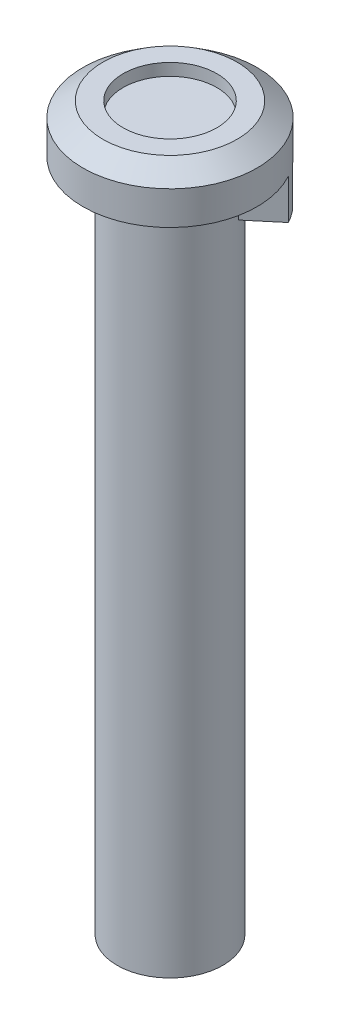
ISO-10303-21;
HEADER;
FILE_DESCRIPTION(('STEP AP214'),'2;1');
FILE_NAME('part.step','',(''),(''),'','','');
FILE_SCHEMA(('AUTOMOTIVE_DESIGN { 1 0 10303 214 1 1 1 1 }'));
ENDSEC;
DATA;
#1=APPLICATION_CONTEXT('core data for automotive mechanical design processes');
#2=APPLICATION_PROTOCOL_DEFINITION('international standard','automotive_design',2000,#1);
#3=PRODUCT_CONTEXT('',#1,'mechanical');
#4=PRODUCT('Part','Part','',(#3));
#5=PRODUCT_RELATED_PRODUCT_CATEGORY('part','',(#4));
#6=PRODUCT_DEFINITION_FORMATION('','',#4);
#7=PRODUCT_DEFINITION_CONTEXT('part definition',#1,'design');
#8=PRODUCT_DEFINITION('design','',#6,#7);
#9=PRODUCT_DEFINITION_SHAPE('','',#8);
#10=(LENGTH_UNIT() NAMED_UNIT(*) SI_UNIT(.MILLI.,.METRE.));
#11=(NAMED_UNIT(*) PLANE_ANGLE_UNIT() SI_UNIT($,.RADIAN.));
#12=(NAMED_UNIT(*) SI_UNIT($,.STERADIAN.) SOLID_ANGLE_UNIT());
#13=UNCERTAINTY_MEASURE_WITH_UNIT(LENGTH_MEASURE(1.E-05),#10,'distance_accuracy_value','');
#14=(GEOMETRIC_REPRESENTATION_CONTEXT(3) GLOBAL_UNCERTAINTY_ASSIGNED_CONTEXT((#13)) GLOBAL_UNIT_ASSIGNED_CONTEXT((#10,
#11,#12)) REPRESENTATION_CONTEXT('',''));
#15=CARTESIAN_POINT('',(0.,0.,0.));
#16=DIRECTION('',(0.,0.,1.));
#17=DIRECTION('',(1.,0.,0.));
#18=AXIS2_PLACEMENT_3D('',#15,#16,#17);
#19=CARTESIAN_POINT('',(-0.803484512108176,0.,-0.957555553898721));
#20=DIRECTION('',(-0.642787609686541,0.,-0.766044443118977));
#21=DIRECTION('',(-0.766044443118977,0.,0.64278760968654));
#22=AXIS2_PLACEMENT_3D('',#19,#20,#21);
#23=PLANE('',#22);
#24=DIRECTION('',(-0.766044443118977,0.,0.64278760968654));
#25=VECTOR('',#24,1.);
#26=CARTESIAN_POINT('',(-0.803484512108176,0.,-0.957555553898721));
#27=LINE('',#26,#25);
#28=CARTESIAN_POINT('',(4.08286434101432,0.,-5.05768907435735));
#29=VERTEX_POINT('',#28);
#30=CARTESIAN_POINT('',(2.06688309626916,0.,-3.36607995543136));
#31=VERTEX_POINT('',#30);
#32=EDGE_CURVE('E110',#29,#31,#27,.T.);
#33=ORIENTED_EDGE('',*,*,#32,.F.);
#34=DIRECTION('',(0.,1.,0.));
#35=VECTOR('',#34,1.);
#36=CARTESIAN_POINT('',(4.08286434101433,-50.3,-5.05768907435735));
#37=LINE('',#36,#35);
#38=CARTESIAN_POINT('',(4.08286434101432,-0.121324588913463,-5.05768907435735));
#39=VERTEX_POINT('',#38);
#40=EDGE_CURVE('E98',#29,#39,#37,.F.);
#41=ORIENTED_EDGE('',*,*,#40,.T.);
#42=DIRECTION('',(0.541675220419704,0.707106781186544,-0.454519477672047));
#43=VECTOR('',#42,1.);
#44=CARTESIAN_POINT('',(4.17580436816517,0.,-5.13567501686123));
#45=LINE('',#44,#43);
#46=CARTESIAN_POINT('',(2.06688309626916,-2.75300120096093,-3.36607995543137));
#47=VERTEX_POINT('',#46);
#48=EDGE_CURVE('E105',#47,#39,#45,.T.);
#49=ORIENTED_EDGE('',*,*,#48,.F.);
#50=DIRECTION('',(0.,1.,0.));
#51=VECTOR('',#50,1.);
#52=CARTESIAN_POINT('',(2.06688309626916,55.,-3.36607995543137));
#53=LINE('',#52,#51);
#54=EDGE_CURVE('E117',#31,#47,#53,.F.);
#55=ORIENTED_EDGE('',*,*,#54,.F.);
#56=EDGE_LOOP('',(#33,#41,#49,#55));
#57=FACE_BOUND('',#56,.T.);
#58=ADVANCED_FACE('F37',(#57),#23,.T.);
#59=CARTESIAN_POINT('',(4.17580436816517,0.,-5.13567501686123));
#60=DIRECTION('',(0.541675220419698,-0.707106781186551,-0.454519477672042));
#61=DIRECTION('',(0.793844806099449,0.608120402411338,0.));
#62=AXIS2_PLACEMENT_3D('',#59,#60,#61);
#63=PLANE('',#62);
#64=ORIENTED_EDGE('',*,*,#48,.T.);
#65=CARTESIAN_POINT('',(0.,-6.49999999999994,0.));
#66=DIRECTION('',(0.541675220419698,-0.707106781186551,-0.454519477672042));
#67=DIRECTION('',(0.541675220419704,0.707106781186544,-0.454519477672047));
#68=AXIS2_PLACEMENT_3D('',#65,#66,#67);
#69=ELLIPSE('',#68,9.19238815542507,6.5);
#70=CARTESIAN_POINT('',(4.97928888027335,0.,-4.17811946296251));
#71=VERTEX_POINT('',#70);
#72=EDGE_CURVE('E89',#39,#71,#69,.T.);
#73=ORIENTED_EDGE('',*,*,#72,.T.);
#74=DIRECTION('',(0.541675220419704,0.707106781186544,-0.454519477672047));
#75=VECTOR('',#74,1.);
#76=CARTESIAN_POINT('',(4.97928888027335,0.,-4.17811946296251));
#77=LINE('',#76,#75);
#78=CARTESIAN_POINT('',(3.02587555031996,-2.54999999999996,-2.53901105826184));
#79=VERTEX_POINT('',#78);
#80=EDGE_CURVE('E103',#79,#71,#77,.T.);
#81=ORIENTED_EDGE('',*,*,#80,.F.);
#82=CARTESIAN_POINT('',(0.,-6.49999999999993,0.));
#83=DIRECTION('',(0.541675220419698,-0.707106781186551,-0.454519477672042));
#84=DIRECTION('',(0.541675220419704,0.707106781186544,-0.454519477672047));
#85=AXIS2_PLACEMENT_3D('',#82,#83,#84);
#86=ELLIPSE('',#85,5.5861435713737,3.95);
#87=EDGE_CURVE('E115',#47,#79,#86,.T.);
#88=ORIENTED_EDGE('',*,*,#87,.F.);
#89=EDGE_LOOP('',(#64,#73,#81,#88));
#90=FACE_BOUND('',#89,.T.);
#91=ADVANCED_FACE('F102',(#90),#63,.T.);
#92=CARTESIAN_POINT('',(5.78277339238152,-3.,-3.22056390906379));
#93=DIRECTION('',(0.,1.,0.));
#94=DIRECTION('',(-1.,0.,0.));
#95=AXIS2_PLACEMENT_3D('',#92,#93,#94);
#96=PLANE('',#95);
#97=CARTESIAN_POINT('',(0.,-3.,0.));
#98=DIRECTION('',(0.,1.,0.));
#99=DIRECTION('',(-1.,0.,0.));
#100=AXIS2_PLACEMENT_3D('',#97,#98,#99);
#101=CIRCLE('',#100,6.5);
#102=CARTESIAN_POINT('',(5.68983336523067,-3.,-3.14257796655991));
#103=VERTEX_POINT('',#102);
#104=CARTESIAN_POINT('',(4.97928888027335,-3.,-4.17811946296251));
#105=VERTEX_POINT('',#104);
#106=EDGE_CURVE('E92',#103,#105,#101,.T.);
#107=ORIENTED_EDGE('',*,*,#106,.F.);
#108=DIRECTION('',(0.766044443118977,0.,-0.642787609686541));
#109=VECTOR('',#108,1.);
#110=CARTESIAN_POINT('',(5.78277339238152,-3.,-3.22056390906379));
#111=LINE('',#110,#109);
#112=CARTESIAN_POINT('',(3.67385212048552,-3.,-1.45096884763392));
#113=VERTEX_POINT('',#112);
#114=EDGE_CURVE('E152',#113,#103,#111,.T.);
#115=ORIENTED_EDGE('',*,*,#114,.F.);
#116=CARTESIAN_POINT('',(0.,-3.,0.));
#117=DIRECTION('',(0.,1.,0.));
#118=DIRECTION('',(-1.,0.,0.));
#119=AXIS2_PLACEMENT_3D('',#116,#117,#118);
#120=CIRCLE('',#119,3.95);
#121=CARTESIAN_POINT('',(3.02587555031997,-3.,-2.53901105826183));
#122=VERTEX_POINT('',#121);
#123=EDGE_CURVE('E12',#113,#122,#120,.T.);
#124=ORIENTED_EDGE('',*,*,#123,.T.);
#125=DIRECTION('',(0.766044443118977,0.,-0.642787609686541));
#126=VECTOR('',#125,1.);
#127=CARTESIAN_POINT('',(4.97928888027335,-3.,-4.17811946296251));
#128=LINE('',#127,#126);
#129=EDGE_CURVE('E97',#122,#105,#128,.T.);
#130=ORIENTED_EDGE('',*,*,#129,.T.);
#131=EDGE_LOOP('',(#107,#115,#124,#130));
#132=FACE_BOUND('',#131,.T.);
#133=ADVANCED_FACE('F161',(#132),#96,.F.);
#134=CARTESIAN_POINT('',(0.803484512108176,0.,0.957555553898722));
#135=DIRECTION('',(-0.642787609686541,0.,-0.766044443118977));
#136=DIRECTION('',(-0.766044443118977,0.,0.642787609686541));
#137=AXIS2_PLACEMENT_3D('',#134,#135,#136);
#138=PLANE('',#137);
#139=DIRECTION('',(0.,1.,0.));
#140=VECTOR('',#139,1.);
#141=CARTESIAN_POINT('',(5.68983336523067,-50.3,-3.14257796655991));
#142=LINE('',#141,#140);
#143=CARTESIAN_POINT('',(5.68983336523068,0.,-3.14257796655991));
#144=VERTEX_POINT('',#143);
#145=EDGE_CURVE('E151',#144,#103,#142,.F.);
#146=ORIENTED_EDGE('',*,*,#145,.F.);
#147=DIRECTION('',(-0.766044443118977,0.,0.64278760968654));
#148=VECTOR('',#147,1.);
#149=CARTESIAN_POINT('',(5.78277339238153,0.,-3.22056390906379));
#150=LINE('',#149,#148);
#151=CARTESIAN_POINT('',(3.67385212048551,0.,-1.45096884763392));
#152=VERTEX_POINT('',#151);
#153=EDGE_CURVE('E145',#144,#152,#150,.T.);
#154=ORIENTED_EDGE('',*,*,#153,.T.);
#155=DIRECTION('',(0.,1.,0.));
#156=VECTOR('',#155,1.);
#157=CARTESIAN_POINT('',(3.67385212048552,55.,-1.45096884763391));
#158=LINE('',#157,#156);
#159=EDGE_CURVE('E108',#152,#113,#158,.F.);
#160=ORIENTED_EDGE('',*,*,#159,.T.);
#161=ORIENTED_EDGE('',*,*,#114,.T.);
#162=EDGE_LOOP('',(#146,#154,#160,#161));
#163=FACE_BOUND('',#162,.T.);
#164=ADVANCED_FACE('F148',(#163),#138,.F.);
#165=CARTESIAN_POINT('',(0.,55.,0.));
#166=DIRECTION('',(0.,1.,0.));
#167=DIRECTION('',(0.,0.,1.));
#168=AXIS2_PLACEMENT_3D('',#165,#166,#167);
#169=CYLINDRICAL_SURFACE('',#168,3.95);
#170=CARTESIAN_POINT('',(0.,-50.3,0.));
#171=DIRECTION('',(0.,1.,0.));
#172=DIRECTION('',(0.,0.,1.));
#173=AXIS2_PLACEMENT_3D('',#170,#171,#172);
#174=CIRCLE('',#173,3.95000000000001);
#175=CARTESIAN_POINT('',(0.,-50.3,3.95000000000001));
#176=VERTEX_POINT('',#175);
#177=EDGE_CURVE('E135',#176,#176,#174,.T.);
#178=ORIENTED_EDGE('',*,*,#177,.T.);
#179=EDGE_LOOP('',(#178));
#180=FACE_BOUND('',#179,.T.);
#181=ORIENTED_EDGE('',*,*,#159,.F.);
#182=CARTESIAN_POINT('',(0.,0.,0.));
#183=DIRECTION('',(0.,1.,0.));
#184=DIRECTION('',(0.,0.,1.));
#185=AXIS2_PLACEMENT_3D('',#182,#183,#184);
#186=CIRCLE('',#185,3.95);
#187=EDGE_CURVE('E45',#31,#152,#186,.T.);
#188=ORIENTED_EDGE('',*,*,#187,.F.);
#189=ORIENTED_EDGE('',*,*,#54,.T.);
#190=ORIENTED_EDGE('',*,*,#87,.T.);
#191=DIRECTION('',(0.,1.,0.));
#192=VECTOR('',#191,1.);
#193=CARTESIAN_POINT('',(3.02587555031997,55.,-2.53901105826183));
#194=LINE('',#193,#192);
#195=EDGE_CURVE('E55',#79,#122,#194,.F.);
#196=ORIENTED_EDGE('',*,*,#195,.T.);
#197=ORIENTED_EDGE('',*,*,#123,.F.);
#198=EDGE_LOOP('',(#181,#188,#189,#190,#196,#197));
#199=FACE_BOUND('',#198,.T.);
#200=ADVANCED_FACE('F39',(#180,#199),#169,.T.);
#201=CARTESIAN_POINT('',(0.,0.,0.));
#202=DIRECTION('',(0.,1.,0.));
#203=DIRECTION('',(0.,0.,1.));
#204=AXIS2_PLACEMENT_3D('',#201,#202,#203);
#205=PLANE('',#204);
#206=ORIENTED_EDGE('',*,*,#153,.F.);
#207=CARTESIAN_POINT('',(0.,0.,0.));
#208=DIRECTION('',(0.,1.,0.));
#209=DIRECTION('',(0.,0.,1.));
#210=AXIS2_PLACEMENT_3D('',#207,#208,#209);
#211=CIRCLE('',#210,6.5);
#212=EDGE_CURVE('E132',#29,#144,#211,.T.);
#213=ORIENTED_EDGE('',*,*,#212,.F.);
#214=ORIENTED_EDGE('',*,*,#32,.T.);
#215=ORIENTED_EDGE('',*,*,#187,.T.);
#216=EDGE_LOOP('',(#206,#213,#214,#215));
#217=FACE_BOUND('',#216,.T.);
#218=ADVANCED_FACE('F143',(#217),#205,.F.);
#219=CARTESIAN_POINT('',(3.95000000000001,-50.3,0.));
#220=DIRECTION('',(0.,1.,0.));
#221=DIRECTION('',(0.,0.,1.));
#222=AXIS2_PLACEMENT_3D('',#219,#220,#221);
#223=PLANE('',#222);
#224=ORIENTED_EDGE('',*,*,#177,.F.);
#225=EDGE_LOOP('',(#224));
#226=FACE_BOUND('',#225,.T.);
#227=ADVANCED_FACE('F195',(#226),#223,.F.);
#228=CARTESIAN_POINT('',(0.,55.,0.));
#229=DIRECTION('',(0.,1.,0.));
#230=DIRECTION('',(0.,0.,1.));
#231=AXIS2_PLACEMENT_3D('',#228,#229,#230);
#232=CYLINDRICAL_SURFACE('',#231,6.5);
#233=CARTESIAN_POINT('',(0.,2.5,0.));
#234=DIRECTION('',(0.,1.,0.));
#235=DIRECTION('',(0.,0.,1.));
#236=AXIS2_PLACEMENT_3D('',#233,#234,#235);
#237=CIRCLE('',#236,6.5);
#238=CARTESIAN_POINT('',(0.,2.5,6.5));
#239=VERTEX_POINT('',#238);
#240=EDGE_CURVE('E129',#239,#239,#237,.T.);
#241=ORIENTED_EDGE('',*,*,#240,.F.);
#242=EDGE_LOOP('',(#241));
#243=FACE_BOUND('',#242,.T.);
#244=DIRECTION('',(0.,1.,0.));
#245=VECTOR('',#244,1.);
#246=CARTESIAN_POINT('',(4.97928888027335,0.,-4.17811946296251));
#247=LINE('',#246,#245);
#248=EDGE_CURVE('E86',#105,#71,#247,.T.);
#249=ORIENTED_EDGE('',*,*,#248,.T.);
#250=ORIENTED_EDGE('',*,*,#72,.F.);
#251=ORIENTED_EDGE('',*,*,#40,.F.);
#252=ORIENTED_EDGE('',*,*,#212,.T.);
#253=ORIENTED_EDGE('',*,*,#145,.T.);
#254=ORIENTED_EDGE('',*,*,#106,.T.);
#255=EDGE_LOOP('',(#249,#250,#251,#252,#253,#254));
#256=FACE_BOUND('',#255,.T.);
#257=ADVANCED_FACE('F88',(#243,#256),#232,.T.);
#258=CARTESIAN_POINT('',(0.,2.5,0.));
#259=DIRECTION('',(0.,-1.,0.));
#260=DIRECTION('',(0.,0.,-1.));
#261=AXIS2_PLACEMENT_3D('',#258,#259,#260);
#262=CONICAL_SURFACE('',#261,6.5,0.938047491792715);
#263=CARTESIAN_POINT('',(0.,3.6,0.));
#264=DIRECTION('',(0.,1.,0.));
#265=DIRECTION('',(0.,0.,1.));
#266=AXIS2_PLACEMENT_3D('',#263,#264,#265);
#267=CIRCLE('',#266,5.);
#268=CARTESIAN_POINT('',(0.,3.6,5.));
#269=VERTEX_POINT('',#268);
#270=EDGE_CURVE('E126',#269,#269,#267,.T.);
#271=ORIENTED_EDGE('',*,*,#270,.F.);
#272=EDGE_LOOP('',(#271));
#273=FACE_BOUND('',#272,.T.);
#274=ORIENTED_EDGE('',*,*,#240,.T.);
#275=EDGE_LOOP('',(#274));
#276=FACE_BOUND('',#275,.T.);
#277=ADVANCED_FACE('F188',(#273,#276),#262,.T.);
#278=CARTESIAN_POINT('',(5.,3.6,0.));
#279=DIRECTION('',(0.,-1.,0.));
#280=DIRECTION('',(0.,0.,-1.));
#281=AXIS2_PLACEMENT_3D('',#278,#279,#280);
#282=PLANE('',#281);
#283=CARTESIAN_POINT('',(0.,3.6,0.));
#284=DIRECTION('',(0.,1.,0.));
#285=DIRECTION('',(0.,0.,1.));
#286=AXIS2_PLACEMENT_3D('',#283,#284,#285);
#287=CIRCLE('',#286,3.5);
#288=CARTESIAN_POINT('',(0.,3.6,3.5));
#289=VERTEX_POINT('',#288);
#290=EDGE_CURVE('E123',#289,#289,#287,.T.);
#291=ORIENTED_EDGE('',*,*,#290,.F.);
#292=EDGE_LOOP('',(#291));
#293=FACE_BOUND('',#292,.T.);
#294=ORIENTED_EDGE('',*,*,#270,.T.);
#295=EDGE_LOOP('',(#294));
#296=FACE_BOUND('',#295,.T.);
#297=ADVANCED_FACE('F184',(#293,#296),#282,.F.);
#298=CARTESIAN_POINT('',(0.,55.,0.));
#299=DIRECTION('',(0.,1.,0.));
#300=DIRECTION('',(0.,0.,1.));
#301=AXIS2_PLACEMENT_3D('',#298,#299,#300);
#302=CYLINDRICAL_SURFACE('',#301,3.5);
#303=CARTESIAN_POINT('',(0.,2.7,0.));
#304=DIRECTION('',(0.,1.,0.));
#305=DIRECTION('',(0.,0.,1.));
#306=AXIS2_PLACEMENT_3D('',#303,#304,#305);
#307=CIRCLE('',#306,3.5);
#308=CARTESIAN_POINT('',(0.,2.7,3.5));
#309=VERTEX_POINT('',#308);
#310=EDGE_CURVE('E120',#309,#309,#307,.T.);
#311=ORIENTED_EDGE('',*,*,#310,.F.);
#312=EDGE_LOOP('',(#311));
#313=FACE_BOUND('',#312,.T.);
#314=ORIENTED_EDGE('',*,*,#290,.T.);
#315=EDGE_LOOP('',(#314));
#316=FACE_BOUND('',#315,.T.);
#317=ADVANCED_FACE('F180',(#313,#316),#302,.F.);
#318=CARTESIAN_POINT('',(3.5,2.7,0.));
#319=DIRECTION('',(0.,-1.,0.));
#320=DIRECTION('',(0.,0.,-1.));
#321=AXIS2_PLACEMENT_3D('',#318,#319,#320);
#322=PLANE('',#321);
#323=ORIENTED_EDGE('',*,*,#310,.T.);
#324=EDGE_LOOP('',(#323));
#325=FACE_BOUND('',#324,.T.);
#326=ADVANCED_FACE('F177',(#325),#322,.F.);
#327=CARTESIAN_POINT('',(0.,0.,0.));
#328=DIRECTION('',(-0.642787609686541,0.,-0.766044443118977));
#329=DIRECTION('',(-0.766044443118977,0.,0.642787609686541));
#330=AXIS2_PLACEMENT_3D('',#327,#328,#329);
#331=PLANE('',#330);
#332=ORIENTED_EDGE('',*,*,#195,.F.);
#333=ORIENTED_EDGE('',*,*,#80,.T.);
#334=ORIENTED_EDGE('',*,*,#248,.F.);
#335=ORIENTED_EDGE('',*,*,#129,.F.);
#336=EDGE_LOOP('',(#332,#333,#334,#335));
#337=FACE_BOUND('',#336,.T.);
#338=ADVANCED_FACE('F107',(#337),#331,.T.);
#339=CLOSED_SHELL('',(#58,#91,#133,#164,#200,#218,#227,#257,#277,#297,#317,#326,#338));
#340=MANIFOLD_SOLID_BREP('B2',#339);
#341=ADVANCED_BREP_SHAPE_REPRESENTATION('',(#18,#340),#14);
#342=SHAPE_DEFINITION_REPRESENTATION(#9,#341);
ENDSEC;
END-ISO-10303-21;
